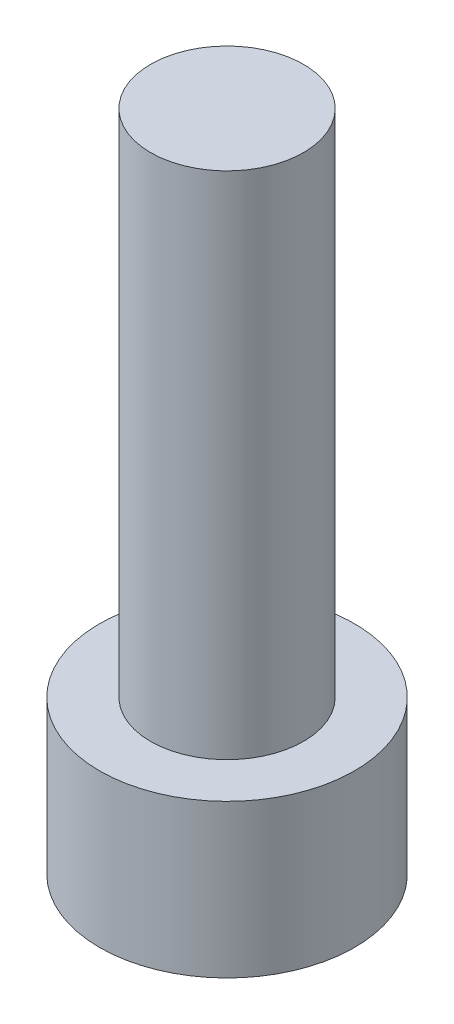
ISO-10303-21;
HEADER;
FILE_DESCRIPTION(('STEP AP214'),'2;1');
FILE_NAME('part.step','',(''),(''),'','','');
FILE_SCHEMA(('AUTOMOTIVE_DESIGN { 1 0 10303 214 1 1 1 1 }'));
ENDSEC;
DATA;
#1=APPLICATION_CONTEXT('core data for automotive mechanical design processes');
#2=APPLICATION_PROTOCOL_DEFINITION('international standard','automotive_design',2000,#1);
#3=PRODUCT_CONTEXT('',#1,'mechanical');
#4=PRODUCT('Part','Part','',(#3));
#5=PRODUCT_RELATED_PRODUCT_CATEGORY('part','',(#4));
#6=PRODUCT_DEFINITION_FORMATION('','',#4);
#7=PRODUCT_DEFINITION_CONTEXT('part definition',#1,'design');
#8=PRODUCT_DEFINITION('design','',#6,#7);
#9=PRODUCT_DEFINITION_SHAPE('','',#8);
#10=(LENGTH_UNIT() NAMED_UNIT(*) SI_UNIT(.MILLI.,.METRE.));
#11=(NAMED_UNIT(*) PLANE_ANGLE_UNIT() SI_UNIT($,.RADIAN.));
#12=(NAMED_UNIT(*) SI_UNIT($,.STERADIAN.) SOLID_ANGLE_UNIT());
#13=UNCERTAINTY_MEASURE_WITH_UNIT(LENGTH_MEASURE(1.E-05),#10,'distance_accuracy_value','');
#14=(GEOMETRIC_REPRESENTATION_CONTEXT(3) GLOBAL_UNCERTAINTY_ASSIGNED_CONTEXT((#13)) GLOBAL_UNIT_ASSIGNED_CONTEXT((#10,
#11,#12)) REPRESENTATION_CONTEXT('',''));
#15=CARTESIAN_POINT('',(0.,0.,0.));
#16=DIRECTION('',(0.,0.,1.));
#17=DIRECTION('',(1.,0.,0.));
#18=AXIS2_PLACEMENT_3D('',#15,#16,#17);
#19=CARTESIAN_POINT('',(0.,3.,0.));
#20=DIRECTION('',(0.,-1.,0.));
#21=DIRECTION('',(0.,0.,-1.));
#22=AXIS2_PLACEMENT_3D('',#19,#20,#21);
#23=CYLINDRICAL_SURFACE('',#22,2.5);
#24=CARTESIAN_POINT('',(0.,3.,0.));
#25=DIRECTION('',(0.,1.,0.));
#26=DIRECTION('',(0.,0.,1.));
#27=AXIS2_PLACEMENT_3D('',#24,#25,#26);
#28=CIRCLE('',#27,2.5);
#29=CARTESIAN_POINT('',(0.,3.,2.5));
#30=VERTEX_POINT('',#29);
#31=EDGE_CURVE('E43',#30,#30,#28,.T.);
#32=ORIENTED_EDGE('',*,*,#31,.F.);
#33=EDGE_LOOP('',(#32));
#34=FACE_BOUND('',#33,.T.);
#35=CARTESIAN_POINT('',(0.,0.,0.));
#36=DIRECTION('',(0.,1.,0.));
#37=DIRECTION('',(0.,0.,1.));
#38=AXIS2_PLACEMENT_3D('',#35,#36,#37);
#39=CIRCLE('',#38,2.5);
#40=CARTESIAN_POINT('',(0.,0.,2.5));
#41=VERTEX_POINT('',#40);
#42=EDGE_CURVE('E38',#41,#41,#39,.T.);
#43=ORIENTED_EDGE('',*,*,#42,.T.);
#44=EDGE_LOOP('',(#43));
#45=FACE_BOUND('',#44,.T.);
#46=ADVANCED_FACE('F35',(#34,#45),#23,.T.);
#47=CARTESIAN_POINT('',(0.,3.,0.));
#48=DIRECTION('',(0.,1.,0.));
#49=DIRECTION('',(0.,0.,1.));
#50=AXIS2_PLACEMENT_3D('',#47,#48,#49);
#51=PLANE('',#50);
#52=CARTESIAN_POINT('',(0.,3.,0.));
#53=DIRECTION('',(0.,1.,0.));
#54=DIRECTION('',(0.,0.,1.));
#55=AXIS2_PLACEMENT_3D('',#52,#53,#54);
#56=CIRCLE('',#55,1.5);
#57=CARTESIAN_POINT('',(0.,3.,1.5));
#58=VERTEX_POINT('',#57);
#59=EDGE_CURVE('E11',#58,#58,#56,.T.);
#60=ORIENTED_EDGE('',*,*,#59,.F.);
#61=EDGE_LOOP('',(#60));
#62=FACE_BOUND('',#61,.T.);
#63=ORIENTED_EDGE('',*,*,#31,.T.);
#64=EDGE_LOOP('',(#63));
#65=FACE_BOUND('',#64,.T.);
#66=ADVANCED_FACE('F155',(#62,#65),#51,.T.);
#67=CARTESIAN_POINT('',(0.,0.,0.));
#68=DIRECTION('',(0.,1.,0.));
#69=DIRECTION('',(0.,0.,1.));
#70=AXIS2_PLACEMENT_3D('',#67,#68,#69);
#71=PLANE('',#70);
#72=DIRECTION('',(-0.5,0.,0.866025403784439));
#73=VECTOR('',#72,1.);
#74=CARTESIAN_POINT('',(1.425,0.,0.));
#75=LINE('',#74,#73);
#76=CARTESIAN_POINT('',(1.425,0.,0.));
#77=VERTEX_POINT('',#76);
#78=CARTESIAN_POINT('',(0.7125,0.,1.23408620039283));
#79=VERTEX_POINT('',#78);
#80=EDGE_CURVE('E125',#77,#79,#75,.T.);
#81=ORIENTED_EDGE('',*,*,#80,.F.);
#82=DIRECTION('',(0.5,0.,0.866025403784439));
#83=VECTOR('',#82,1.);
#84=CARTESIAN_POINT('',(0.7125,0.,-1.23408620039283));
#85=LINE('',#84,#83);
#86=CARTESIAN_POINT('',(0.7125,0.,-1.23408620039283));
#87=VERTEX_POINT('',#86);
#88=EDGE_CURVE('E51',#87,#77,#85,.T.);
#89=ORIENTED_EDGE('',*,*,#88,.F.);
#90=DIRECTION('',(1.,0.,0.));
#91=VECTOR('',#90,1.);
#92=CARTESIAN_POINT('',(-0.7125,0.,-1.23408620039283));
#93=LINE('',#92,#91);
#94=CARTESIAN_POINT('',(-0.7125,0.,-1.23408620039283));
#95=VERTEX_POINT('',#94);
#96=EDGE_CURVE('E134',#95,#87,#93,.T.);
#97=ORIENTED_EDGE('',*,*,#96,.F.);
#98=DIRECTION('',(0.5,0.,-0.866025403784439));
#99=VECTOR('',#98,1.);
#100=CARTESIAN_POINT('',(-1.425,0.,0.));
#101=LINE('',#100,#99);
#102=CARTESIAN_POINT('',(-1.425,0.,0.));
#103=VERTEX_POINT('',#102);
#104=EDGE_CURVE('E132',#103,#95,#101,.T.);
#105=ORIENTED_EDGE('',*,*,#104,.F.);
#106=DIRECTION('',(-0.5,0.,-0.866025403784439));
#107=VECTOR('',#106,1.);
#108=CARTESIAN_POINT('',(-0.7125,0.,1.23408620039283));
#109=LINE('',#108,#107);
#110=CARTESIAN_POINT('',(-0.7125,0.,1.23408620039283));
#111=VERTEX_POINT('',#110);
#112=EDGE_CURVE('E99',#111,#103,#109,.T.);
#113=ORIENTED_EDGE('',*,*,#112,.F.);
#114=DIRECTION('',(-1.,0.,0.));
#115=VECTOR('',#114,1.);
#116=CARTESIAN_POINT('',(0.7125,0.,1.23408620039283));
#117=LINE('',#116,#115);
#118=EDGE_CURVE('E128',#79,#111,#117,.T.);
#119=ORIENTED_EDGE('',*,*,#118,.F.);
#120=EDGE_LOOP('',(#81,#89,#97,#105,#113,#119));
#121=FACE_BOUND('',#120,.T.);
#122=ORIENTED_EDGE('',*,*,#42,.F.);
#123=EDGE_LOOP('',(#122));
#124=FACE_BOUND('',#123,.T.);
#125=ADVANCED_FACE('F152',(#121,#124),#71,.F.);
#126=CARTESIAN_POINT('',(0.,13.,0.));
#127=DIRECTION('',(0.,-1.,0.));
#128=DIRECTION('',(0.,0.,-1.));
#129=AXIS2_PLACEMENT_3D('',#126,#127,#128);
#130=CYLINDRICAL_SURFACE('',#129,1.5);
#131=CARTESIAN_POINT('',(0.,13.,0.));
#132=DIRECTION('',(0.,1.,0.));
#133=DIRECTION('',(0.,0.,1.));
#134=AXIS2_PLACEMENT_3D('',#131,#132,#133);
#135=CIRCLE('',#134,1.5);
#136=CARTESIAN_POINT('',(0.,13.,1.5));
#137=VERTEX_POINT('',#136);
#138=EDGE_CURVE('E138',#137,#137,#135,.T.);
#139=ORIENTED_EDGE('',*,*,#138,.F.);
#140=EDGE_LOOP('',(#139));
#141=FACE_BOUND('',#140,.T.);
#142=ORIENTED_EDGE('',*,*,#59,.T.);
#143=EDGE_LOOP('',(#142));
#144=FACE_BOUND('',#143,.T.);
#145=ADVANCED_FACE('F154',(#141,#144),#130,.T.);
#146=CARTESIAN_POINT('',(0.,13.,0.));
#147=DIRECTION('',(0.,1.,0.));
#148=DIRECTION('',(0.,0.,1.));
#149=AXIS2_PLACEMENT_3D('',#146,#147,#148);
#150=PLANE('',#149);
#151=ORIENTED_EDGE('',*,*,#138,.T.);
#152=EDGE_LOOP('',(#151));
#153=FACE_BOUND('',#152,.T.);
#154=ADVANCED_FACE('F161',(#153),#150,.T.);
#155=CARTESIAN_POINT('',(0.7125,1.65,-1.23408620039283));
#156=DIRECTION('',(0.866025403784439,0.,-0.5));
#157=DIRECTION('',(-0.5,0.,-0.866025403784439));
#158=AXIS2_PLACEMENT_3D('',#155,#156,#157);
#159=PLANE('',#158);
#160=ORIENTED_EDGE('',*,*,#88,.T.);
#161=DIRECTION('',(0.,-1.,0.));
#162=VECTOR('',#161,1.);
#163=CARTESIAN_POINT('',(1.425,1.65,0.));
#164=LINE('',#163,#162);
#165=CARTESIAN_POINT('',(1.425,1.65,0.));
#166=VERTEX_POINT('',#165);
#167=EDGE_CURVE('E81',#166,#77,#164,.T.);
#168=ORIENTED_EDGE('',*,*,#167,.F.);
#169=DIRECTION('',(0.5,0.,0.866025403784439));
#170=VECTOR('',#169,1.);
#171=CARTESIAN_POINT('',(0.7125,1.65,-1.23408620039283));
#172=LINE('',#171,#170);
#173=CARTESIAN_POINT('',(0.7125,1.65,-1.23408620039283));
#174=VERTEX_POINT('',#173);
#175=EDGE_CURVE('E136',#174,#166,#172,.T.);
#176=ORIENTED_EDGE('',*,*,#175,.F.);
#177=DIRECTION('',(0.,-1.,0.));
#178=VECTOR('',#177,1.);
#179=CARTESIAN_POINT('',(0.7125,1.65,-1.23408620039283));
#180=LINE('',#179,#178);
#181=EDGE_CURVE('E59',#174,#87,#180,.T.);
#182=ORIENTED_EDGE('',*,*,#181,.T.);
#183=EDGE_LOOP('',(#160,#168,#176,#182));
#184=FACE_BOUND('',#183,.T.);
#185=ADVANCED_FACE('F190',(#184),#159,.F.);
#186=CARTESIAN_POINT('',(-0.7125,1.65,-1.23408620039283));
#187=DIRECTION('',(0.,0.,-1.));
#188=DIRECTION('',(-1.,0.,0.));
#189=AXIS2_PLACEMENT_3D('',#186,#187,#188);
#190=PLANE('',#189);
#191=ORIENTED_EDGE('',*,*,#96,.T.);
#192=ORIENTED_EDGE('',*,*,#181,.F.);
#193=DIRECTION('',(1.,0.,0.));
#194=VECTOR('',#193,1.);
#195=CARTESIAN_POINT('',(-0.7125,1.65,-1.23408620039283));
#196=LINE('',#195,#194);
#197=CARTESIAN_POINT('',(-0.7125,1.65,-1.23408620039283));
#198=VERTEX_POINT('',#197);
#199=EDGE_CURVE('E111',#198,#174,#196,.T.);
#200=ORIENTED_EDGE('',*,*,#199,.F.);
#201=DIRECTION('',(0.,-1.,0.));
#202=VECTOR('',#201,1.);
#203=CARTESIAN_POINT('',(-0.7125,1.65,-1.23408620039283));
#204=LINE('',#203,#202);
#205=EDGE_CURVE('E103',#198,#95,#204,.T.);
#206=ORIENTED_EDGE('',*,*,#205,.T.);
#207=EDGE_LOOP('',(#191,#192,#200,#206));
#208=FACE_BOUND('',#207,.T.);
#209=ADVANCED_FACE('F204',(#208),#190,.F.);
#210=CARTESIAN_POINT('',(-1.425,1.65,0.));
#211=DIRECTION('',(-0.866025403784439,0.,-0.5));
#212=DIRECTION('',(-0.5,0.,0.866025403784439));
#213=AXIS2_PLACEMENT_3D('',#210,#211,#212);
#214=PLANE('',#213);
#215=ORIENTED_EDGE('',*,*,#104,.T.);
#216=ORIENTED_EDGE('',*,*,#205,.F.);
#217=DIRECTION('',(0.5,0.,-0.866025403784439));
#218=VECTOR('',#217,1.);
#219=CARTESIAN_POINT('',(-1.425,1.65,0.));
#220=LINE('',#219,#218);
#221=CARTESIAN_POINT('',(-1.425,1.65,0.));
#222=VERTEX_POINT('',#221);
#223=EDGE_CURVE('E107',#222,#198,#220,.T.);
#224=ORIENTED_EDGE('',*,*,#223,.F.);
#225=DIRECTION('',(0.,-1.,0.));
#226=VECTOR('',#225,1.);
#227=CARTESIAN_POINT('',(-1.425,1.65,0.));
#228=LINE('',#227,#226);
#229=EDGE_CURVE('E92',#222,#103,#228,.T.);
#230=ORIENTED_EDGE('',*,*,#229,.T.);
#231=EDGE_LOOP('',(#215,#216,#224,#230));
#232=FACE_BOUND('',#231,.T.);
#233=ADVANCED_FACE('F108',(#232),#214,.F.);
#234=CARTESIAN_POINT('',(-0.7125,1.65,1.23408620039283));
#235=DIRECTION('',(-0.866025403784439,0.,0.5));
#236=DIRECTION('',(0.5,0.,0.866025403784439));
#237=AXIS2_PLACEMENT_3D('',#234,#235,#236);
#238=PLANE('',#237);
#239=ORIENTED_EDGE('',*,*,#112,.T.);
#240=ORIENTED_EDGE('',*,*,#229,.F.);
#241=DIRECTION('',(-0.5,0.,-0.866025403784439));
#242=VECTOR('',#241,1.);
#243=CARTESIAN_POINT('',(-0.7125,1.65,1.23408620039283));
#244=LINE('',#243,#242);
#245=CARTESIAN_POINT('',(-0.7125,1.65,1.23408620039283));
#246=VERTEX_POINT('',#245);
#247=EDGE_CURVE('E96',#246,#222,#244,.T.);
#248=ORIENTED_EDGE('',*,*,#247,.F.);
#249=DIRECTION('',(0.,-1.,0.));
#250=VECTOR('',#249,1.);
#251=CARTESIAN_POINT('',(-0.7125,1.65,1.23408620039283));
#252=LINE('',#251,#250);
#253=EDGE_CURVE('E104',#246,#111,#252,.T.);
#254=ORIENTED_EDGE('',*,*,#253,.T.);
#255=EDGE_LOOP('',(#239,#240,#248,#254));
#256=FACE_BOUND('',#255,.T.);
#257=ADVANCED_FACE('F94',(#256),#238,.F.);
#258=CARTESIAN_POINT('',(0.7125,1.65,1.23408620039283));
#259=DIRECTION('',(0.,0.,1.));
#260=DIRECTION('',(1.,0.,0.));
#261=AXIS2_PLACEMENT_3D('',#258,#259,#260);
#262=PLANE('',#261);
#263=ORIENTED_EDGE('',*,*,#118,.T.);
#264=ORIENTED_EDGE('',*,*,#253,.F.);
#265=DIRECTION('',(-1.,0.,0.));
#266=VECTOR('',#265,1.);
#267=CARTESIAN_POINT('',(0.7125,1.65,1.23408620039283));
#268=LINE('',#267,#266);
#269=CARTESIAN_POINT('',(0.7125,1.65,1.23408620039283));
#270=VERTEX_POINT('',#269);
#271=EDGE_CURVE('E117',#270,#246,#268,.T.);
#272=ORIENTED_EDGE('',*,*,#271,.F.);
#273=DIRECTION('',(0.,-1.,0.));
#274=VECTOR('',#273,1.);
#275=CARTESIAN_POINT('',(0.7125,1.65,1.23408620039283));
#276=LINE('',#275,#274);
#277=EDGE_CURVE('E141',#270,#79,#276,.T.);
#278=ORIENTED_EDGE('',*,*,#277,.T.);
#279=EDGE_LOOP('',(#263,#264,#272,#278));
#280=FACE_BOUND('',#279,.T.);
#281=ADVANCED_FACE('F229',(#280),#262,.F.);
#282=CARTESIAN_POINT('',(1.425,1.65,0.));
#283=DIRECTION('',(0.866025403784439,0.,0.5));
#284=DIRECTION('',(0.5,0.,-0.866025403784438));
#285=AXIS2_PLACEMENT_3D('',#282,#283,#284);
#286=PLANE('',#285);
#287=ORIENTED_EDGE('',*,*,#80,.T.);
#288=ORIENTED_EDGE('',*,*,#277,.F.);
#289=DIRECTION('',(-0.5,0.,0.866025403784439));
#290=VECTOR('',#289,1.);
#291=CARTESIAN_POINT('',(1.425,1.65,0.));
#292=LINE('',#291,#290);
#293=EDGE_CURVE('E119',#166,#270,#292,.T.);
#294=ORIENTED_EDGE('',*,*,#293,.F.);
#295=ORIENTED_EDGE('',*,*,#167,.T.);
#296=EDGE_LOOP('',(#287,#288,#294,#295));
#297=FACE_BOUND('',#296,.T.);
#298=ADVANCED_FACE('F238',(#297),#286,.F.);
#299=CARTESIAN_POINT('',(0.,1.65,0.));
#300=DIRECTION('',(0.,-1.,0.));
#301=DIRECTION('',(0.,0.,-1.));
#302=AXIS2_PLACEMENT_3D('',#299,#300,#301);
#303=PLANE('',#302);
#304=ORIENTED_EDGE('',*,*,#175,.T.);
#305=ORIENTED_EDGE('',*,*,#293,.T.);
#306=ORIENTED_EDGE('',*,*,#271,.T.);
#307=ORIENTED_EDGE('',*,*,#247,.T.);
#308=ORIENTED_EDGE('',*,*,#223,.T.);
#309=ORIENTED_EDGE('',*,*,#199,.T.);
#310=EDGE_LOOP('',(#304,#305,#306,#307,#308,#309));
#311=FACE_BOUND('',#310,.T.);
#312=ADVANCED_FACE('F114',(#311),#303,.T.);
#313=CLOSED_SHELL('',(#46,#66,#125,#145,#154,#185,#209,#233,#257,#281,#298,#312));
#314=MANIFOLD_SOLID_BREP('B2',#313);
#315=ADVANCED_BREP_SHAPE_REPRESENTATION('',(#18,#314),#14);
#316=SHAPE_DEFINITION_REPRESENTATION(#9,#315);
ENDSEC;
END-ISO-10303-21;
